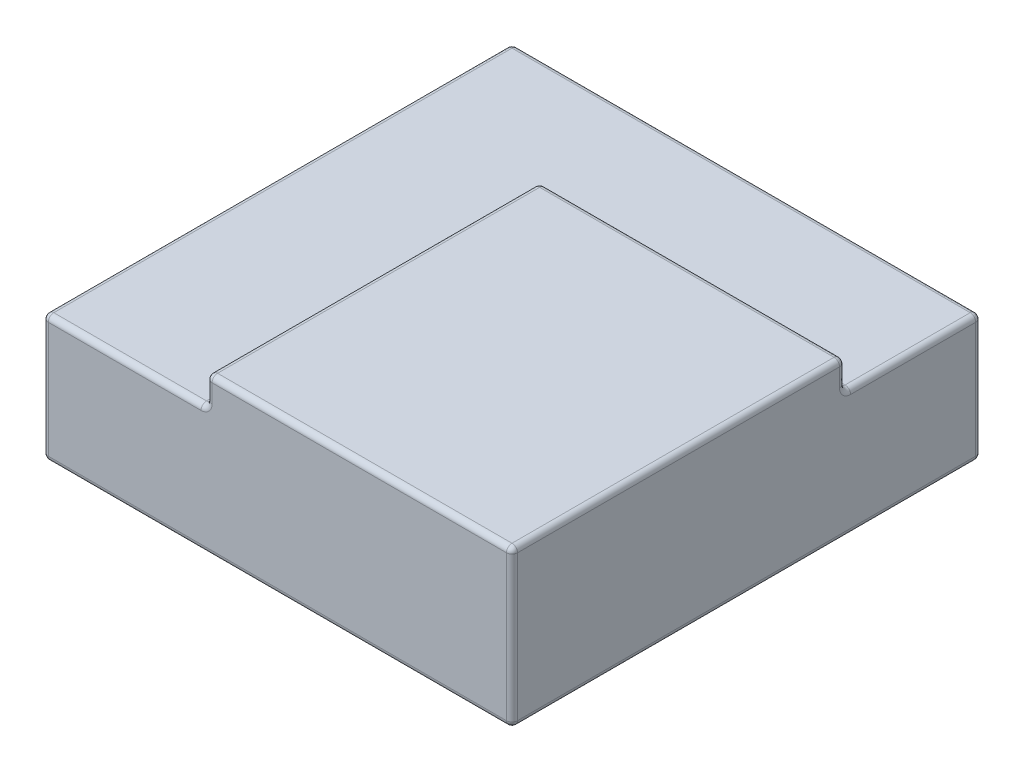
ISO-10303-21;
HEADER;
FILE_DESCRIPTION(('STEP AP214'),'2;1');
FILE_NAME('part.step','',(''),(''),'','','');
FILE_SCHEMA(('AUTOMOTIVE_DESIGN { 1 0 10303 214 1 1 1 1 }'));
ENDSEC;
DATA;
#1=APPLICATION_CONTEXT('core data for automotive mechanical design processes');
#2=APPLICATION_PROTOCOL_DEFINITION('international standard','automotive_design',2000,#1);
#3=PRODUCT_CONTEXT('',#1,'mechanical');
#4=PRODUCT('Part','Part','',(#3));
#5=PRODUCT_RELATED_PRODUCT_CATEGORY('part','',(#4));
#6=PRODUCT_DEFINITION_FORMATION('','',#4);
#7=PRODUCT_DEFINITION_CONTEXT('part definition',#1,'design');
#8=PRODUCT_DEFINITION('design','',#6,#7);
#9=PRODUCT_DEFINITION_SHAPE('','',#8);
#10=(LENGTH_UNIT() NAMED_UNIT(*) SI_UNIT(.MILLI.,.METRE.));
#11=(NAMED_UNIT(*) PLANE_ANGLE_UNIT() SI_UNIT($,.RADIAN.));
#12=(NAMED_UNIT(*) SI_UNIT($,.STERADIAN.) SOLID_ANGLE_UNIT());
#13=UNCERTAINTY_MEASURE_WITH_UNIT(LENGTH_MEASURE(1.E-05),#10,'distance_accuracy_value','');
#14=(GEOMETRIC_REPRESENTATION_CONTEXT(3) GLOBAL_UNCERTAINTY_ASSIGNED_CONTEXT((#13)) GLOBAL_UNIT_ASSIGNED_CONTEXT((#10,
#11,#12)) REPRESENTATION_CONTEXT('',''));
#15=CARTESIAN_POINT('',(0.,0.,0.));
#16=DIRECTION('',(0.,0.,1.));
#17=DIRECTION('',(1.,0.,0.));
#18=AXIS2_PLACEMENT_3D('',#15,#16,#17);
#19=CARTESIAN_POINT('',(0.,17.526,0.));
#20=DIRECTION('',(0.,1.,0.));
#21=DIRECTION('',(0.,0.,1.));
#22=AXIS2_PLACEMENT_3D('',#19,#20,#21);
#23=PLANE('',#22);
#24=CARTESIAN_POINT('',(-9.01699999999989,17.526,-12.8269999999999));
#25=DIRECTION('',(0.,1.,0.));
#26=DIRECTION('',(0.,0.,1.));
#27=AXIS2_PLACEMENT_3D('',#24,#25,#26);
#28=CIRCLE('',#27,1.524);
#29=CARTESIAN_POINT('',(-9.01699999999989,17.526,-14.3509999999999));
#30=VERTEX_POINT('',#29);
#31=CARTESIAN_POINT('',(-10.5409999999999,17.526,-12.8269999999999));
#32=VERTEX_POINT('',#31);
#33=EDGE_CURVE('E304',#30,#32,#28,.T.);
#34=ORIENTED_EDGE('',*,*,#33,.F.);
#35=DIRECTION('',(-1.,0.,0.));
#36=VECTOR('',#35,1.);
#37=CARTESIAN_POINT('',(32.3850000000001,17.526,-14.3509999999999));
#38=LINE('',#37,#36);
#39=CARTESIAN_POINT('',(31.6230000000001,17.526,-14.3509999999999));
#40=VERTEX_POINT('',#39);
#41=EDGE_CURVE('E301',#30,#40,#38,.F.);
#42=ORIENTED_EDGE('',*,*,#41,.T.);
#43=DIRECTION('',(0.,0.,-1.));
#44=VECTOR('',#43,1.);
#45=CARTESIAN_POINT('',(31.6230000000001,17.526,-32.3850000000001));
#46=LINE('',#45,#44);
#47=CARTESIAN_POINT('',(31.6230000000001,17.526,-31.6230000000001));
#48=VERTEX_POINT('',#47);
#49=EDGE_CURVE('E291',#40,#48,#46,.T.);
#50=ORIENTED_EDGE('',*,*,#49,.T.);
#51=DIRECTION('',(-1.,0.,0.));
#52=VECTOR('',#51,1.);
#53=CARTESIAN_POINT('',(-32.3850000000001,17.526,-31.6230000000001));
#54=LINE('',#53,#52);
#55=CARTESIAN_POINT('',(-31.6230000000001,17.526,-31.6230000000001));
#56=VERTEX_POINT('',#55);
#57=EDGE_CURVE('E293',#48,#56,#54,.T.);
#58=ORIENTED_EDGE('',*,*,#57,.T.);
#59=DIRECTION('',(0.,0.,1.));
#60=VECTOR('',#59,1.);
#61=CARTESIAN_POINT('',(-31.6230000000001,17.526,32.3850000000001));
#62=LINE('',#61,#60);
#63=CARTESIAN_POINT('',(-31.6230000000001,17.526,31.6230000000001));
#64=VERTEX_POINT('',#63);
#65=EDGE_CURVE('E295',#56,#64,#62,.T.);
#66=ORIENTED_EDGE('',*,*,#65,.T.);
#67=DIRECTION('',(1.,0.,0.));
#68=VECTOR('',#67,1.);
#69=CARTESIAN_POINT('',(-9.77899999999998,17.526,31.6230000000001));
#70=LINE('',#69,#68);
#71=CARTESIAN_POINT('',(-10.541,17.526,31.6230000000001));
#72=VERTEX_POINT('',#71);
#73=EDGE_CURVE('E297',#64,#72,#70,.T.);
#74=ORIENTED_EDGE('',*,*,#73,.T.);
#75=DIRECTION('',(0.,0.,1.));
#76=VECTOR('',#75,1.);
#77=CARTESIAN_POINT('',(-10.5409999999999,17.526,-13.5889999999999));
#78=LINE('',#77,#76);
#79=EDGE_CURVE('E299',#72,#32,#78,.F.);
#80=ORIENTED_EDGE('',*,*,#79,.T.);
#81=EDGE_LOOP('',(#34,#42,#50,#58,#66,#74,#80));
#82=FACE_BOUND('',#81,.T.);
#83=ADVANCED_FACE('F34',(#82),#23,.T.);
#84=CARTESIAN_POINT('',(32.3850000000001,21.59,32.3850000000001));
#85=DIRECTION('',(-1.,0.,0.));
#86=DIRECTION('',(0.,0.,1.));
#87=AXIS2_PLACEMENT_3D('',#84,#85,#86);
#88=PLANE('',#87);
#89=DIRECTION('',(0.,0.,-1.));
#90=VECTOR('',#89,1.);
#91=CARTESIAN_POINT('',(32.3850000000001,0.761999999999999,-32.3850000000001));
#92=LINE('',#91,#90);
#93=CARTESIAN_POINT('',(32.3850000000001,0.761999999999999,31.6230000000001));
#94=VERTEX_POINT('',#93);
#95=CARTESIAN_POINT('',(32.3850000000001,0.761999999999999,-31.6230000000001));
#96=VERTEX_POINT('',#95);
#97=EDGE_CURVE('E236',#94,#96,#92,.T.);
#98=ORIENTED_EDGE('',*,*,#97,.T.);
#99=DIRECTION('',(0.,-1.,0.));
#100=VECTOR('',#99,1.);
#101=CARTESIAN_POINT('',(32.3850000000001,21.59,-31.6230000000001));
#102=LINE('',#101,#100);
#103=CARTESIAN_POINT('',(32.3850000000001,16.764,-31.6230000000001));
#104=VERTEX_POINT('',#103);
#105=EDGE_CURVE('E246',#96,#104,#102,.F.);
#106=ORIENTED_EDGE('',*,*,#105,.T.);
#107=DIRECTION('',(0.,0.,-1.));
#108=VECTOR('',#107,1.);
#109=CARTESIAN_POINT('',(32.3850000000001,16.764,-13.5889999999999));
#110=LINE('',#109,#108);
#111=CARTESIAN_POINT('',(32.3850000000001,16.764,-14.3509999999999));
#112=VERTEX_POINT('',#111);
#113=EDGE_CURVE('E244',#104,#112,#110,.F.);
#114=ORIENTED_EDGE('',*,*,#113,.T.);
#115=CARTESIAN_POINT('',(32.3850000000001,18.288,-14.3509999999999));
#116=DIRECTION('',(-1.,0.,0.));
#117=DIRECTION('',(0.,0.,1.));
#118=AXIS2_PLACEMENT_3D('',#115,#116,#117);
#119=CIRCLE('',#118,1.524);
#120=CARTESIAN_POINT('',(32.3850000000001,18.288,-12.8269999999999));
#121=VERTEX_POINT('',#120);
#122=EDGE_CURVE('E241',#121,#112,#119,.F.);
#123=ORIENTED_EDGE('',*,*,#122,.F.);
#124=DIRECTION('',(0.,1.,0.));
#125=VECTOR('',#124,1.);
#126=CARTESIAN_POINT('',(32.3850000000001,21.59,-12.8269999999999));
#127=LINE('',#126,#125);
#128=CARTESIAN_POINT('',(32.3850000000001,20.828,-12.8269999999999));
#129=VERTEX_POINT('',#128);
#130=EDGE_CURVE('E238',#121,#129,#127,.T.);
#131=ORIENTED_EDGE('',*,*,#130,.T.);
#132=DIRECTION('',(0.,0.,-1.));
#133=VECTOR('',#132,1.);
#134=CARTESIAN_POINT('',(32.3850000000001,20.828,32.3850000000001));
#135=LINE('',#134,#133);
#136=CARTESIAN_POINT('',(32.3850000000001,20.828,31.6230000000001));
#137=VERTEX_POINT('',#136);
#138=EDGE_CURVE('E232',#129,#137,#135,.F.);
#139=ORIENTED_EDGE('',*,*,#138,.T.);
#140=DIRECTION('',(0.,-1.,0.));
#141=VECTOR('',#140,1.);
#142=CARTESIAN_POINT('',(32.3850000000001,21.59,31.6230000000001));
#143=LINE('',#142,#141);
#144=EDGE_CURVE('E234',#137,#94,#143,.T.);
#145=ORIENTED_EDGE('',*,*,#144,.T.);
#146=EDGE_LOOP('',(#98,#106,#114,#123,#131,#139,#145));
#147=FACE_BOUND('',#146,.T.);
#148=ADVANCED_FACE('F499',(#147),#88,.F.);
#149=CARTESIAN_POINT('',(-32.3850000000001,21.59,-32.3850000000001));
#150=DIRECTION('',(0.,0.,1.));
#151=DIRECTION('',(1.,0.,0.));
#152=AXIS2_PLACEMENT_3D('',#149,#150,#151);
#153=PLANE('',#152);
#154=DIRECTION('',(-1.,0.,0.));
#155=VECTOR('',#154,1.);
#156=CARTESIAN_POINT('',(-32.3850000000001,0.761999999999999,-32.3850000000001));
#157=LINE('',#156,#155);
#158=CARTESIAN_POINT('',(31.6230000000001,0.761999999999999,-32.3850000000001));
#159=VERTEX_POINT('',#158);
#160=CARTESIAN_POINT('',(-31.6230000000001,0.761999999999999,-32.3850000000001));
#161=VERTEX_POINT('',#160);
#162=EDGE_CURVE('E286',#159,#161,#157,.T.);
#163=ORIENTED_EDGE('',*,*,#162,.T.);
#164=DIRECTION('',(0.,-1.,0.));
#165=VECTOR('',#164,1.);
#166=CARTESIAN_POINT('',(-31.6230000000001,21.59,-32.3850000000001));
#167=LINE('',#166,#165);
#168=CARTESIAN_POINT('',(-31.6230000000001,16.764,-32.3850000000001));
#169=VERTEX_POINT('',#168);
#170=EDGE_CURVE('E288',#161,#169,#167,.F.);
#171=ORIENTED_EDGE('',*,*,#170,.T.);
#172=DIRECTION('',(-1.,0.,0.));
#173=VECTOR('',#172,1.);
#174=CARTESIAN_POINT('',(32.3850000000001,16.764,-32.3850000000001));
#175=LINE('',#174,#173);
#176=CARTESIAN_POINT('',(31.6230000000001,16.764,-32.3850000000001));
#177=VERTEX_POINT('',#176);
#178=EDGE_CURVE('E282',#169,#177,#175,.F.);
#179=ORIENTED_EDGE('',*,*,#178,.T.);
#180=DIRECTION('',(0.,-1.,0.));
#181=VECTOR('',#180,1.);
#182=CARTESIAN_POINT('',(31.6230000000001,21.59,-32.3850000000001));
#183=LINE('',#182,#181);
#184=EDGE_CURVE('E284',#177,#159,#183,.T.);
#185=ORIENTED_EDGE('',*,*,#184,.T.);
#186=EDGE_LOOP('',(#163,#171,#179,#185));
#187=FACE_BOUND('',#186,.T.);
#188=ADVANCED_FACE('F481',(#187),#153,.F.);
#189=CARTESIAN_POINT('',(-32.3850000000001,21.59,32.3850000000001));
#190=DIRECTION('',(1.,0.,0.));
#191=DIRECTION('',(0.,0.,-1.));
#192=AXIS2_PLACEMENT_3D('',#189,#190,#191);
#193=PLANE('',#192);
#194=DIRECTION('',(0.,0.,1.));
#195=VECTOR('',#194,1.);
#196=CARTESIAN_POINT('',(-32.3850000000001,0.761999999999999,32.3850000000001));
#197=LINE('',#196,#195);
#198=CARTESIAN_POINT('',(-32.3850000000001,0.761999999999999,-31.6230000000001));
#199=VERTEX_POINT('',#198);
#200=CARTESIAN_POINT('',(-32.3850000000001,0.761999999999999,31.6230000000001));
#201=VERTEX_POINT('',#200);
#202=EDGE_CURVE('E277',#199,#201,#197,.T.);
#203=ORIENTED_EDGE('',*,*,#202,.T.);
#204=DIRECTION('',(0.,-1.,0.));
#205=VECTOR('',#204,1.);
#206=CARTESIAN_POINT('',(-32.3850000000001,21.59,31.6230000000001));
#207=LINE('',#206,#205);
#208=CARTESIAN_POINT('',(-32.3850000000001,16.764,31.6230000000001));
#209=VERTEX_POINT('',#208);
#210=EDGE_CURVE('E279',#201,#209,#207,.F.);
#211=ORIENTED_EDGE('',*,*,#210,.T.);
#212=DIRECTION('',(0.,0.,1.));
#213=VECTOR('',#212,1.);
#214=CARTESIAN_POINT('',(-32.3850000000001,16.764,-32.3850000000001));
#215=LINE('',#214,#213);
#216=CARTESIAN_POINT('',(-32.3850000000001,16.764,-31.6230000000001));
#217=VERTEX_POINT('',#216);
#218=EDGE_CURVE('E273',#209,#217,#215,.F.);
#219=ORIENTED_EDGE('',*,*,#218,.T.);
#220=DIRECTION('',(0.,-1.,0.));
#221=VECTOR('',#220,1.);
#222=CARTESIAN_POINT('',(-32.3850000000001,21.59,-31.6230000000001));
#223=LINE('',#222,#221);
#224=EDGE_CURVE('E275',#217,#199,#223,.T.);
#225=ORIENTED_EDGE('',*,*,#224,.T.);
#226=EDGE_LOOP('',(#203,#211,#219,#225));
#227=FACE_BOUND('',#226,.T.);
#228=ADVANCED_FACE('F459',(#227),#193,.F.);
#229=CARTESIAN_POINT('',(0.,21.59,0.));
#230=DIRECTION('',(0.,-1.,0.));
#231=DIRECTION('',(0.,0.,-1.));
#232=AXIS2_PLACEMENT_3D('',#229,#230,#231);
#233=PLANE('',#232);
#234=DIRECTION('',(0.,0.,-1.));
#235=VECTOR('',#234,1.);
#236=CARTESIAN_POINT('',(31.6230000000001,21.59,0.));
#237=LINE('',#236,#235);
#238=CARTESIAN_POINT('',(31.6230000000001,21.59,31.6230000000001));
#239=VERTEX_POINT('',#238);
#240=CARTESIAN_POINT('',(31.6230000000001,21.59,-12.8269999999999));
#241=VERTEX_POINT('',#240);
#242=EDGE_CURVE('E43',#239,#241,#237,.T.);
#243=ORIENTED_EDGE('',*,*,#242,.T.);
#244=DIRECTION('',(-1.,0.,0.));
#245=VECTOR('',#244,1.);
#246=CARTESIAN_POINT('',(-9.77899999999989,21.59,-12.8269999999999));
#247=LINE('',#246,#245);
#248=CARTESIAN_POINT('',(-9.01699999999989,21.59,-12.8269999999999));
#249=VERTEX_POINT('',#248);
#250=EDGE_CURVE('E12',#241,#249,#247,.T.);
#251=ORIENTED_EDGE('',*,*,#250,.T.);
#252=DIRECTION('',(0.,0.,1.));
#253=VECTOR('',#252,1.);
#254=CARTESIAN_POINT('',(-9.01699999999998,21.59,32.3850000000001));
#255=LINE('',#254,#253);
#256=CARTESIAN_POINT('',(-9.01699999999998,21.59,31.6230000000001));
#257=VERTEX_POINT('',#256);
#258=EDGE_CURVE('E307',#249,#257,#255,.T.);
#259=ORIENTED_EDGE('',*,*,#258,.T.);
#260=DIRECTION('',(1.,0.,0.));
#261=VECTOR('',#260,1.);
#262=CARTESIAN_POINT('',(0.,21.59,31.6230000000001));
#263=LINE('',#262,#261);
#264=EDGE_CURVE('E54',#257,#239,#263,.T.);
#265=ORIENTED_EDGE('',*,*,#264,.T.);
#266=EDGE_LOOP('',(#243,#251,#259,#265));
#267=FACE_BOUND('',#266,.T.);
#268=ADVANCED_FACE('F509',(#267),#233,.F.);
#269=CARTESIAN_POINT('',(-32.3850000000001,21.59,32.3850000000001));
#270=DIRECTION('',(0.,0.,-1.));
#271=DIRECTION('',(-1.,0.,0.));
#272=AXIS2_PLACEMENT_3D('',#269,#270,#271);
#273=PLANE('',#272);
#274=DIRECTION('',(1.,0.,0.));
#275=VECTOR('',#274,1.);
#276=CARTESIAN_POINT('',(-32.3850000000001,16.764,32.3850000000001));
#277=LINE('',#276,#275);
#278=CARTESIAN_POINT('',(-10.541,16.764,32.3850000000001));
#279=VERTEX_POINT('',#278);
#280=CARTESIAN_POINT('',(-31.6230000000001,16.764,32.3850000000001));
#281=VERTEX_POINT('',#280);
#282=EDGE_CURVE('E269',#279,#281,#277,.F.);
#283=ORIENTED_EDGE('',*,*,#282,.T.);
#284=DIRECTION('',(0.,-1.,0.));
#285=VECTOR('',#284,1.);
#286=CARTESIAN_POINT('',(-31.6230000000001,21.59,32.3850000000001));
#287=LINE('',#286,#285);
#288=CARTESIAN_POINT('',(-31.6230000000001,0.761999999999999,32.3850000000001));
#289=VERTEX_POINT('',#288);
#290=EDGE_CURVE('E271',#281,#289,#287,.T.);
#291=ORIENTED_EDGE('',*,*,#290,.T.);
#292=DIRECTION('',(1.,0.,0.));
#293=VECTOR('',#292,1.);
#294=CARTESIAN_POINT('',(32.3850000000001,0.761999999999999,32.3850000000001));
#295=LINE('',#294,#293);
#296=CARTESIAN_POINT('',(31.6230000000001,0.761999999999999,32.3850000000001));
#297=VERTEX_POINT('',#296);
#298=EDGE_CURVE('E267',#289,#297,#295,.T.);
#299=ORIENTED_EDGE('',*,*,#298,.T.);
#300=DIRECTION('',(0.,-1.,0.));
#301=VECTOR('',#300,1.);
#302=CARTESIAN_POINT('',(31.6230000000001,21.59,32.3850000000001));
#303=LINE('',#302,#301);
#304=CARTESIAN_POINT('',(31.6230000000001,20.828,32.3850000000001));
#305=VERTEX_POINT('',#304);
#306=EDGE_CURVE('E261',#297,#305,#303,.F.);
#307=ORIENTED_EDGE('',*,*,#306,.T.);
#308=DIRECTION('',(1.,0.,0.));
#309=VECTOR('',#308,1.);
#310=CARTESIAN_POINT('',(-32.3850000000001,20.828,32.3850000000001));
#311=LINE('',#310,#309);
#312=CARTESIAN_POINT('',(-9.01699999999998,20.828,32.3850000000001));
#313=VERTEX_POINT('',#312);
#314=EDGE_CURVE('E257',#305,#313,#311,.F.);
#315=ORIENTED_EDGE('',*,*,#314,.T.);
#316=DIRECTION('',(0.,1.,0.));
#317=VECTOR('',#316,1.);
#318=CARTESIAN_POINT('',(-9.01699999999998,17.526,32.3850000000001));
#319=LINE('',#318,#317);
#320=CARTESIAN_POINT('',(-9.01699999999998,18.288,32.3850000000001));
#321=VERTEX_POINT('',#320);
#322=EDGE_CURVE('E259',#313,#321,#319,.F.);
#323=ORIENTED_EDGE('',*,*,#322,.T.);
#324=CARTESIAN_POINT('',(-10.541,18.288,32.3850000000001));
#325=DIRECTION('',(0.,0.,-1.));
#326=DIRECTION('',(-1.,0.,0.));
#327=AXIS2_PLACEMENT_3D('',#324,#325,#326);
#328=CIRCLE('',#327,1.524);
#329=EDGE_CURVE('E264',#279,#321,#328,.F.);
#330=ORIENTED_EDGE('',*,*,#329,.F.);
#331=EDGE_LOOP('',(#283,#291,#299,#307,#315,#323,#330));
#332=FACE_BOUND('',#331,.T.);
#333=ADVANCED_FACE('F512',(#332),#273,.F.);
#334=CARTESIAN_POINT('',(0.,0.,0.));
#335=DIRECTION('',(0.,-1.,0.));
#336=DIRECTION('',(0.,0.,-1.));
#337=AXIS2_PLACEMENT_3D('',#334,#335,#336);
#338=PLANE('',#337);
#339=DIRECTION('',(-1.,0.,0.));
#340=VECTOR('',#339,1.);
#341=CARTESIAN_POINT('',(32.3850000000001,0.,-31.6230000000001));
#342=LINE('',#341,#340);
#343=CARTESIAN_POINT('',(-31.6230000000001,0.,-31.6230000000001));
#344=VERTEX_POINT('',#343);
#345=CARTESIAN_POINT('',(31.6230000000001,0.,-31.6230000000001));
#346=VERTEX_POINT('',#345);
#347=EDGE_CURVE('E248',#344,#346,#342,.F.);
#348=ORIENTED_EDGE('',*,*,#347,.T.);
#349=DIRECTION('',(0.,0.,-1.));
#350=VECTOR('',#349,1.);
#351=CARTESIAN_POINT('',(31.6230000000001,0.,32.3850000000001));
#352=LINE('',#351,#350);
#353=CARTESIAN_POINT('',(31.6230000000001,0.,31.6230000000001));
#354=VERTEX_POINT('',#353);
#355=EDGE_CURVE('E254',#346,#354,#352,.F.);
#356=ORIENTED_EDGE('',*,*,#355,.T.);
#357=DIRECTION('',(1.,0.,0.));
#358=VECTOR('',#357,1.);
#359=CARTESIAN_POINT('',(-32.3850000000001,0.,31.6230000000001));
#360=LINE('',#359,#358);
#361=CARTESIAN_POINT('',(-31.6230000000001,0.,31.6230000000001));
#362=VERTEX_POINT('',#361);
#363=EDGE_CURVE('E252',#354,#362,#360,.F.);
#364=ORIENTED_EDGE('',*,*,#363,.T.);
#365=DIRECTION('',(0.,0.,1.));
#366=VECTOR('',#365,1.);
#367=CARTESIAN_POINT('',(-31.6230000000001,0.,-32.3850000000001));
#368=LINE('',#367,#366);
#369=EDGE_CURVE('E250',#362,#344,#368,.F.);
#370=ORIENTED_EDGE('',*,*,#369,.T.);
#371=EDGE_LOOP('',(#348,#356,#364,#370));
#372=FACE_BOUND('',#371,.T.);
#373=ADVANCED_FACE('F435',(#372),#338,.T.);
#374=CARTESIAN_POINT('',(-9.77899999999998,17.526,32.3850000000001));
#375=DIRECTION('',(-1.,0.,0.));
#376=DIRECTION('',(0.,0.,1.));
#377=AXIS2_PLACEMENT_3D('',#374,#375,#376);
#378=PLANE('',#377);
#379=DIRECTION('',(0.,1.,0.));
#380=VECTOR('',#379,1.);
#381=CARTESIAN_POINT('',(-9.77899999999989,17.526,-12.8269999999999));
#382=LINE('',#381,#380);
#383=CARTESIAN_POINT('',(-9.77899999999989,20.828,-12.8269999999999));
#384=VERTEX_POINT('',#383);
#385=CARTESIAN_POINT('',(-9.77899999999989,18.288,-12.8269999999999));
#386=VERTEX_POINT('',#385);
#387=EDGE_CURVE('E193',#384,#386,#382,.F.);
#388=ORIENTED_EDGE('',*,*,#387,.T.);
#389=DIRECTION('',(0.,0.,1.));
#390=VECTOR('',#389,1.);
#391=CARTESIAN_POINT('',(-9.77899999999998,18.288,32.3850000000001));
#392=LINE('',#391,#390);
#393=CARTESIAN_POINT('',(-9.77899999999998,18.288,31.6230000000001));
#394=VERTEX_POINT('',#393);
#395=EDGE_CURVE('E230',#386,#394,#392,.T.);
#396=ORIENTED_EDGE('',*,*,#395,.T.);
#397=DIRECTION('',(0.,1.,0.));
#398=VECTOR('',#397,1.);
#399=CARTESIAN_POINT('',(-9.77899999999998,21.59,31.6230000000001));
#400=LINE('',#399,#398);
#401=CARTESIAN_POINT('',(-9.77899999999998,20.828,31.6230000000001));
#402=VERTEX_POINT('',#401);
#403=EDGE_CURVE('E227',#394,#402,#400,.T.);
#404=ORIENTED_EDGE('',*,*,#403,.T.);
#405=DIRECTION('',(0.,0.,1.));
#406=VECTOR('',#405,1.);
#407=CARTESIAN_POINT('',(-9.77899999999989,20.828,-13.5889999999999));
#408=LINE('',#407,#406);
#409=EDGE_CURVE('E222',#402,#384,#408,.F.);
#410=ORIENTED_EDGE('',*,*,#409,.T.);
#411=EDGE_LOOP('',(#388,#396,#404,#410));
#412=FACE_BOUND('',#411,.T.);
#413=ADVANCED_FACE('F515',(#412),#378,.T.);
#414=CARTESIAN_POINT('',(32.3850000000001,17.526,-13.5889999999999));
#415=DIRECTION('',(0.,0.,-1.));
#416=DIRECTION('',(-1.,0.,0.));
#417=AXIS2_PLACEMENT_3D('',#414,#415,#416);
#418=PLANE('',#417);
#419=DIRECTION('',(0.,1.,0.));
#420=VECTOR('',#419,1.);
#421=CARTESIAN_POINT('',(31.6230000000001,17.526,-13.5889999999999));
#422=LINE('',#421,#420);
#423=CARTESIAN_POINT('',(31.6230000000001,20.828,-13.5889999999999));
#424=VERTEX_POINT('',#423);
#425=CARTESIAN_POINT('',(31.6230000000001,18.288,-13.5889999999999));
#426=VERTEX_POINT('',#425);
#427=EDGE_CURVE('E215',#424,#426,#422,.F.);
#428=ORIENTED_EDGE('',*,*,#427,.T.);
#429=DIRECTION('',(-1.,0.,0.));
#430=VECTOR('',#429,1.);
#431=CARTESIAN_POINT('',(-9.77899999999989,18.288,-13.5889999999999));
#432=LINE('',#431,#430);
#433=CARTESIAN_POINT('',(-9.01699999999989,18.288,-13.5889999999999));
#434=VERTEX_POINT('',#433);
#435=EDGE_CURVE('E219',#426,#434,#432,.T.);
#436=ORIENTED_EDGE('',*,*,#435,.T.);
#437=DIRECTION('',(0.,1.,0.));
#438=VECTOR('',#437,1.);
#439=CARTESIAN_POINT('',(-9.01699999999989,17.526,-13.5889999999999));
#440=LINE('',#439,#438);
#441=CARTESIAN_POINT('',(-9.01699999999989,20.828,-13.5889999999999));
#442=VERTEX_POINT('',#441);
#443=EDGE_CURVE('E191',#434,#442,#440,.T.);
#444=ORIENTED_EDGE('',*,*,#443,.T.);
#445=DIRECTION('',(-1.,0.,0.));
#446=VECTOR('',#445,1.);
#447=CARTESIAN_POINT('',(32.3850000000001,20.828,-13.5889999999999));
#448=LINE('',#447,#446);
#449=EDGE_CURVE('E209',#442,#424,#448,.F.);
#450=ORIENTED_EDGE('',*,*,#449,.T.);
#451=EDGE_LOOP('',(#428,#436,#444,#450));
#452=FACE_BOUND('',#451,.T.);
#453=ADVANCED_FACE('F217',(#452),#418,.T.);
#454=CARTESIAN_POINT('',(-31.6230000000001,0.762,-31.6230000000001));
#455=DIRECTION('',(0.,0.,1.));
#456=DIRECTION('',(1.,0.,0.));
#457=AXIS2_PLACEMENT_3D('',#454,#455,#456);
#458=SPHERICAL_SURFACE('',#457,0.762);
#459=CARTESIAN_POINT('',(-31.6230000000001,0.761999999999999,-31.6230000000001));
#460=DIRECTION('',(-1.,0.,0.));
#461=DIRECTION('',(0.,0.,1.));
#462=AXIS2_PLACEMENT_3D('',#459,#460,#461);
#463=CIRCLE('',#462,0.762);
#464=EDGE_CURVE('E410',#344,#161,#463,.F.);
#465=ORIENTED_EDGE('',*,*,#464,.F.);
#466=CARTESIAN_POINT('',(-31.6230000000001,0.762,-31.6230000000001));
#467=DIRECTION('',(0.,0.,-1.));
#468=DIRECTION('',(-1.,0.,0.));
#469=AXIS2_PLACEMENT_3D('',#466,#467,#468);
#470=CIRCLE('',#469,0.762);
#471=EDGE_CURVE('E38',#199,#344,#470,.F.);
#472=ORIENTED_EDGE('',*,*,#471,.F.);
#473=CARTESIAN_POINT('',(-31.6230000000001,0.761999999999999,-31.6230000000001));
#474=DIRECTION('',(0.,-1.,0.));
#475=DIRECTION('',(0.,0.,-1.));
#476=AXIS2_PLACEMENT_3D('',#473,#474,#475);
#477=CIRCLE('',#476,0.762);
#478=EDGE_CURVE('E412',#161,#199,#477,.F.);
#479=ORIENTED_EDGE('',*,*,#478,.F.);
#480=EDGE_LOOP('',(#465,#472,#479));
#481=FACE_BOUND('',#480,.T.);
#482=ADVANCED_FACE('F36',(#481),#458,.T.);
#483=CARTESIAN_POINT('',(-31.6230000000001,0.761999999999999,32.3850000000001));
#484=DIRECTION('',(0.,0.,-1.));
#485=DIRECTION('',(-1.,0.,0.));
#486=AXIS2_PLACEMENT_3D('',#483,#484,#485);
#487=CYLINDRICAL_SURFACE('',#486,0.762);
#488=ORIENTED_EDGE('',*,*,#471,.T.);
#489=ORIENTED_EDGE('',*,*,#369,.F.);
#490=CARTESIAN_POINT('',(-31.6230000000001,0.761999999999999,31.6230000000001));
#491=DIRECTION('',(0.,0.,1.));
#492=DIRECTION('',(1.,0.,0.));
#493=AXIS2_PLACEMENT_3D('',#490,#491,#492);
#494=CIRCLE('',#493,0.762);
#495=EDGE_CURVE('E404',#201,#362,#494,.T.);
#496=ORIENTED_EDGE('',*,*,#495,.F.);
#497=ORIENTED_EDGE('',*,*,#202,.F.);
#498=EDGE_LOOP('',(#488,#489,#496,#497));
#499=FACE_BOUND('',#498,.T.);
#500=ADVANCED_FACE('F424',(#499),#487,.T.);
#501=CARTESIAN_POINT('',(-31.6230000000001,21.59,-31.6230000000001));
#502=DIRECTION('',(0.,-1.,0.));
#503=DIRECTION('',(0.,0.,-1.));
#504=AXIS2_PLACEMENT_3D('',#501,#502,#503);
#505=CYLINDRICAL_SURFACE('',#504,0.762);
#506=ORIENTED_EDGE('',*,*,#478,.T.);
#507=ORIENTED_EDGE('',*,*,#224,.F.);
#508=CARTESIAN_POINT('',(-31.6230000000001,16.764,-31.6230000000001));
#509=DIRECTION('',(0.,1.,0.));
#510=DIRECTION('',(0.,0.,1.));
#511=AXIS2_PLACEMENT_3D('',#508,#509,#510);
#512=CIRCLE('',#511,0.762);
#513=EDGE_CURVE('E401',#169,#217,#512,.T.);
#514=ORIENTED_EDGE('',*,*,#513,.F.);
#515=ORIENTED_EDGE('',*,*,#170,.F.);
#516=EDGE_LOOP('',(#506,#507,#514,#515));
#517=FACE_BOUND('',#516,.T.);
#518=ADVANCED_FACE('F461',(#517),#505,.T.);
#519=CARTESIAN_POINT('',(-32.3850000000001,0.761999999999999,-31.6230000000001));
#520=DIRECTION('',(1.,0.,0.));
#521=DIRECTION('',(0.,0.,-1.));
#522=AXIS2_PLACEMENT_3D('',#519,#520,#521);
#523=CYLINDRICAL_SURFACE('',#522,0.762);
#524=ORIENTED_EDGE('',*,*,#464,.T.);
#525=ORIENTED_EDGE('',*,*,#162,.F.);
#526=CARTESIAN_POINT('',(31.6230000000001,0.762,-31.6230000000001));
#527=DIRECTION('',(1.,0.,0.));
#528=DIRECTION('',(0.,0.,-1.));
#529=AXIS2_PLACEMENT_3D('',#526,#527,#528);
#530=CIRCLE('',#529,0.762);
#531=EDGE_CURVE('E398',#346,#159,#530,.T.);
#532=ORIENTED_EDGE('',*,*,#531,.F.);
#533=ORIENTED_EDGE('',*,*,#347,.F.);
#534=EDGE_LOOP('',(#524,#525,#532,#533));
#535=FACE_BOUND('',#534,.T.);
#536=ADVANCED_FACE('F432',(#535),#523,.T.);
#537=CARTESIAN_POINT('',(31.6230000000001,0.761999999999999,32.3850000000001));
#538=DIRECTION('',(0.,0.,1.));
#539=DIRECTION('',(1.,0.,0.));
#540=AXIS2_PLACEMENT_3D('',#537,#538,#539);
#541=CYLINDRICAL_SURFACE('',#540,0.762);
#542=CARTESIAN_POINT('',(31.6230000000001,0.762,31.6230000000001));
#543=DIRECTION('',(0.,0.,1.));
#544=DIRECTION('',(1.,0.,0.));
#545=AXIS2_PLACEMENT_3D('',#542,#543,#544);
#546=CIRCLE('',#545,0.762);
#547=EDGE_CURVE('E392',#354,#94,#546,.T.);
#548=ORIENTED_EDGE('',*,*,#547,.F.);
#549=ORIENTED_EDGE('',*,*,#355,.F.);
#550=CARTESIAN_POINT('',(31.6230000000001,0.761999999999999,-31.6230000000001));
#551=DIRECTION('',(0.,0.,-1.));
#552=DIRECTION('',(-1.,0.,0.));
#553=AXIS2_PLACEMENT_3D('',#550,#551,#552);
#554=CIRCLE('',#553,0.762);
#555=EDGE_CURVE('E395',#96,#346,#554,.T.);
#556=ORIENTED_EDGE('',*,*,#555,.F.);
#557=ORIENTED_EDGE('',*,*,#97,.F.);
#558=EDGE_LOOP('',(#548,#549,#556,#557));
#559=FACE_BOUND('',#558,.T.);
#560=ADVANCED_FACE('F439',(#559),#541,.T.);
#561=CARTESIAN_POINT('',(-32.3850000000001,0.761999999999999,31.6230000000001));
#562=DIRECTION('',(-1.,0.,0.));
#563=DIRECTION('',(0.,0.,1.));
#564=AXIS2_PLACEMENT_3D('',#561,#562,#563);
#565=CYLINDRICAL_SURFACE('',#564,0.762);
#566=CARTESIAN_POINT('',(-31.6230000000001,0.762,31.6230000000001));
#567=DIRECTION('',(-1.,0.,0.));
#568=DIRECTION('',(0.,0.,1.));
#569=AXIS2_PLACEMENT_3D('',#566,#567,#568);
#570=CIRCLE('',#569,0.762);
#571=EDGE_CURVE('E407',#362,#289,#570,.T.);
#572=ORIENTED_EDGE('',*,*,#571,.F.);
#573=ORIENTED_EDGE('',*,*,#363,.F.);
#574=CARTESIAN_POINT('',(31.6230000000001,0.761999999999999,31.6230000000001));
#575=DIRECTION('',(1.,0.,0.));
#576=DIRECTION('',(0.,0.,-1.));
#577=AXIS2_PLACEMENT_3D('',#574,#575,#576);
#578=CIRCLE('',#577,0.762);
#579=EDGE_CURVE('E390',#297,#354,#578,.T.);
#580=ORIENTED_EDGE('',*,*,#579,.F.);
#581=ORIENTED_EDGE('',*,*,#298,.F.);
#582=EDGE_LOOP('',(#572,#573,#580,#581));
#583=FACE_BOUND('',#582,.T.);
#584=ADVANCED_FACE('F447',(#583),#565,.T.);
#585=CARTESIAN_POINT('',(-31.6230000000001,0.762,31.6230000000001));
#586=DIRECTION('',(0.,0.,1.));
#587=DIRECTION('',(1.,0.,0.));
#588=AXIS2_PLACEMENT_3D('',#585,#586,#587);
#589=SPHERICAL_SURFACE('',#588,0.762);
#590=ORIENTED_EDGE('',*,*,#495,.T.);
#591=ORIENTED_EDGE('',*,*,#571,.T.);
#592=CARTESIAN_POINT('',(-31.6230000000001,0.761999999999999,31.6230000000001));
#593=DIRECTION('',(0.,-1.,0.));
#594=DIRECTION('',(0.,0.,-1.));
#595=AXIS2_PLACEMENT_3D('',#592,#593,#594);
#596=CIRCLE('',#595,0.762);
#597=EDGE_CURVE('E387',#201,#289,#596,.F.);
#598=ORIENTED_EDGE('',*,*,#597,.F.);
#599=EDGE_LOOP('',(#590,#591,#598));
#600=FACE_BOUND('',#599,.T.);
#601=ADVANCED_FACE('F451',(#600),#589,.T.);
#602=CARTESIAN_POINT('',(-31.6230000000001,16.764,-31.6230000000001));
#603=DIRECTION('',(0.,0.,1.));
#604=DIRECTION('',(1.,0.,0.));
#605=AXIS2_PLACEMENT_3D('',#602,#603,#604);
#606=SPHERICAL_SURFACE('',#605,0.762);
#607=CARTESIAN_POINT('',(-31.6230000000001,16.764,-31.6230000000001));
#608=DIRECTION('',(-1.,0.,0.));
#609=DIRECTION('',(0.,0.,1.));
#610=AXIS2_PLACEMENT_3D('',#607,#608,#609);
#611=CIRCLE('',#610,0.762);
#612=EDGE_CURVE('E381',#169,#56,#611,.F.);
#613=ORIENTED_EDGE('',*,*,#612,.F.);
#614=ORIENTED_EDGE('',*,*,#513,.T.);
#615=CARTESIAN_POINT('',(-31.6230000000001,16.764,-31.6230000000001));
#616=DIRECTION('',(0.,0.,-1.));
#617=DIRECTION('',(-1.,0.,0.));
#618=AXIS2_PLACEMENT_3D('',#615,#616,#617);
#619=CIRCLE('',#618,0.762);
#620=EDGE_CURVE('E384',#56,#217,#619,.F.);
#621=ORIENTED_EDGE('',*,*,#620,.F.);
#622=EDGE_LOOP('',(#613,#614,#621));
#623=FACE_BOUND('',#622,.T.);
#624=ADVANCED_FACE('F465',(#623),#606,.T.);
#625=CARTESIAN_POINT('',(31.6230000000001,0.762,-31.6230000000001));
#626=DIRECTION('',(0.,0.,1.));
#627=DIRECTION('',(1.,0.,0.));
#628=AXIS2_PLACEMENT_3D('',#625,#626,#627);
#629=SPHERICAL_SURFACE('',#628,0.762);
#630=ORIENTED_EDGE('',*,*,#555,.T.);
#631=ORIENTED_EDGE('',*,*,#531,.T.);
#632=CARTESIAN_POINT('',(31.6230000000001,0.761999999999999,-31.6230000000001));
#633=DIRECTION('',(0.,-1.,0.));
#634=DIRECTION('',(0.,0.,-1.));
#635=AXIS2_PLACEMENT_3D('',#632,#633,#634);
#636=CIRCLE('',#635,0.762);
#637=EDGE_CURVE('E378',#96,#159,#636,.F.);
#638=ORIENTED_EDGE('',*,*,#637,.F.);
#639=EDGE_LOOP('',(#630,#631,#638));
#640=FACE_BOUND('',#639,.T.);
#641=ADVANCED_FACE('F488',(#640),#629,.T.);
#642=CARTESIAN_POINT('',(31.6230000000001,0.762,31.6230000000001));
#643=DIRECTION('',(0.,0.,1.));
#644=DIRECTION('',(1.,0.,0.));
#645=AXIS2_PLACEMENT_3D('',#642,#643,#644);
#646=SPHERICAL_SURFACE('',#645,0.762);
#647=ORIENTED_EDGE('',*,*,#579,.T.);
#648=ORIENTED_EDGE('',*,*,#547,.T.);
#649=CARTESIAN_POINT('',(31.6230000000001,0.761999999999999,31.6230000000001));
#650=DIRECTION('',(0.,-1.,0.));
#651=DIRECTION('',(0.,0.,-1.));
#652=AXIS2_PLACEMENT_3D('',#649,#650,#651);
#653=CIRCLE('',#652,0.762);
#654=EDGE_CURVE('E375',#297,#94,#653,.F.);
#655=ORIENTED_EDGE('',*,*,#654,.F.);
#656=EDGE_LOOP('',(#647,#648,#655));
#657=FACE_BOUND('',#656,.T.);
#658=ADVANCED_FACE('F490',(#657),#646,.T.);
#659=CARTESIAN_POINT('',(-31.6230000000001,21.59,31.6230000000001));
#660=DIRECTION('',(0.,-1.,0.));
#661=DIRECTION('',(0.,0.,-1.));
#662=AXIS2_PLACEMENT_3D('',#659,#660,#661);
#663=CYLINDRICAL_SURFACE('',#662,0.762);
#664=ORIENTED_EDGE('',*,*,#597,.T.);
#665=ORIENTED_EDGE('',*,*,#290,.F.);
#666=CARTESIAN_POINT('',(-31.6230000000001,16.764,31.6230000000001));
#667=DIRECTION('',(0.,1.,0.));
#668=DIRECTION('',(0.,0.,1.));
#669=AXIS2_PLACEMENT_3D('',#666,#667,#668);
#670=CIRCLE('',#669,0.762);
#671=EDGE_CURVE('E372',#209,#281,#670,.T.);
#672=ORIENTED_EDGE('',*,*,#671,.F.);
#673=ORIENTED_EDGE('',*,*,#210,.F.);
#674=EDGE_LOOP('',(#664,#665,#672,#673));
#675=FACE_BOUND('',#674,.T.);
#676=ADVANCED_FACE('F456',(#675),#663,.T.);
#677=CARTESIAN_POINT('',(-31.6230000000001,16.764,0.));
#678=DIRECTION('',(0.,0.,-1.));
#679=DIRECTION('',(-1.,0.,0.));
#680=AXIS2_PLACEMENT_3D('',#677,#678,#679);
#681=CYLINDRICAL_SURFACE('',#680,0.762);
#682=ORIENTED_EDGE('',*,*,#620,.T.);
#683=ORIENTED_EDGE('',*,*,#218,.F.);
#684=CARTESIAN_POINT('',(-31.6230000000001,16.764,31.6230000000001));
#685=DIRECTION('',(0.,0.,1.));
#686=DIRECTION('',(1.,0.,0.));
#687=AXIS2_PLACEMENT_3D('',#684,#685,#686);
#688=CIRCLE('',#687,0.762);
#689=EDGE_CURVE('E370',#64,#209,#688,.T.);
#690=ORIENTED_EDGE('',*,*,#689,.F.);
#691=ORIENTED_EDGE('',*,*,#65,.F.);
#692=EDGE_LOOP('',(#682,#683,#690,#691));
#693=FACE_BOUND('',#692,.T.);
#694=ADVANCED_FACE('F468',(#693),#681,.T.);
#695=CARTESIAN_POINT('',(0.,16.764,-31.6230000000001));
#696=DIRECTION('',(1.,0.,0.));
#697=DIRECTION('',(0.,0.,-1.));
#698=AXIS2_PLACEMENT_3D('',#695,#696,#697);
#699=CYLINDRICAL_SURFACE('',#698,0.762);
#700=ORIENTED_EDGE('',*,*,#612,.T.);
#701=ORIENTED_EDGE('',*,*,#57,.F.);
#702=CARTESIAN_POINT('',(31.6230000000001,16.764,-31.6230000000001));
#703=DIRECTION('',(1.,0.,0.));
#704=DIRECTION('',(0.,0.,-1.));
#705=AXIS2_PLACEMENT_3D('',#702,#703,#704);
#706=CIRCLE('',#705,0.762);
#707=EDGE_CURVE('E367',#177,#48,#706,.T.);
#708=ORIENTED_EDGE('',*,*,#707,.F.);
#709=ORIENTED_EDGE('',*,*,#178,.F.);
#710=EDGE_LOOP('',(#700,#701,#708,#709));
#711=FACE_BOUND('',#710,.T.);
#712=ADVANCED_FACE('F478',(#711),#699,.T.);
#713=CARTESIAN_POINT('',(31.6230000000001,21.59,-31.6230000000001));
#714=DIRECTION('',(0.,-1.,0.));
#715=DIRECTION('',(0.,0.,-1.));
#716=AXIS2_PLACEMENT_3D('',#713,#714,#715);
#717=CYLINDRICAL_SURFACE('',#716,0.762);
#718=ORIENTED_EDGE('',*,*,#637,.T.);
#719=ORIENTED_EDGE('',*,*,#184,.F.);
#720=CARTESIAN_POINT('',(31.6230000000001,16.764,-31.6230000000001));
#721=DIRECTION('',(0.,1.,0.));
#722=DIRECTION('',(0.,0.,1.));
#723=AXIS2_PLACEMENT_3D('',#720,#721,#722);
#724=CIRCLE('',#723,0.762);
#725=EDGE_CURVE('E364',#104,#177,#724,.T.);
#726=ORIENTED_EDGE('',*,*,#725,.F.);
#727=ORIENTED_EDGE('',*,*,#105,.F.);
#728=EDGE_LOOP('',(#718,#719,#726,#727));
#729=FACE_BOUND('',#728,.T.);
#730=ADVANCED_FACE('F484',(#729),#717,.T.);
#731=CARTESIAN_POINT('',(31.6230000000001,21.59,31.6230000000001));
#732=DIRECTION('',(0.,-1.,0.));
#733=DIRECTION('',(0.,0.,-1.));
#734=AXIS2_PLACEMENT_3D('',#731,#732,#733);
#735=CYLINDRICAL_SURFACE('',#734,0.762);
#736=ORIENTED_EDGE('',*,*,#654,.T.);
#737=ORIENTED_EDGE('',*,*,#144,.F.);
#738=CARTESIAN_POINT('',(31.6230000000001,20.828,31.6230000000001));
#739=DIRECTION('',(0.,1.,0.));
#740=DIRECTION('',(0.,0.,1.));
#741=AXIS2_PLACEMENT_3D('',#738,#739,#740);
#742=CIRCLE('',#741,0.762);
#743=EDGE_CURVE('E361',#305,#137,#742,.T.);
#744=ORIENTED_EDGE('',*,*,#743,.F.);
#745=ORIENTED_EDGE('',*,*,#306,.F.);
#746=EDGE_LOOP('',(#736,#737,#744,#745));
#747=FACE_BOUND('',#746,.T.);
#748=ADVANCED_FACE('F596',(#747),#735,.T.);
#749=CARTESIAN_POINT('',(-31.6230000000001,16.764,31.6230000000001));
#750=DIRECTION('',(0.,0.,1.));
#751=DIRECTION('',(1.,0.,0.));
#752=AXIS2_PLACEMENT_3D('',#749,#750,#751);
#753=SPHERICAL_SURFACE('',#752,0.762);
#754=ORIENTED_EDGE('',*,*,#689,.T.);
#755=ORIENTED_EDGE('',*,*,#671,.T.);
#756=CARTESIAN_POINT('',(-31.6230000000001,16.764,31.6230000000001));
#757=DIRECTION('',(-1.,0.,0.));
#758=DIRECTION('',(0.,0.,1.));
#759=AXIS2_PLACEMENT_3D('',#756,#757,#758);
#760=CIRCLE('',#759,0.762);
#761=EDGE_CURVE('E358',#64,#281,#760,.F.);
#762=ORIENTED_EDGE('',*,*,#761,.F.);
#763=EDGE_LOOP('',(#754,#755,#762));
#764=FACE_BOUND('',#763,.T.);
#765=ADVANCED_FACE('F592',(#764),#753,.T.);
#766=CARTESIAN_POINT('',(31.6230000000001,16.764,-31.6230000000001));
#767=DIRECTION('',(0.,0.,1.));
#768=DIRECTION('',(1.,0.,0.));
#769=AXIS2_PLACEMENT_3D('',#766,#767,#768);
#770=SPHERICAL_SURFACE('',#769,0.762);
#771=ORIENTED_EDGE('',*,*,#725,.T.);
#772=ORIENTED_EDGE('',*,*,#707,.T.);
#773=CARTESIAN_POINT('',(31.6230000000001,16.764,-31.6230000000001));
#774=DIRECTION('',(0.,0.,-1.));
#775=DIRECTION('',(-1.,0.,0.));
#776=AXIS2_PLACEMENT_3D('',#773,#774,#775);
#777=CIRCLE('',#776,0.762);
#778=EDGE_CURVE('E355',#104,#48,#777,.F.);
#779=ORIENTED_EDGE('',*,*,#778,.F.);
#780=EDGE_LOOP('',(#771,#772,#779));
#781=FACE_BOUND('',#780,.T.);
#782=ADVANCED_FACE('F588',(#781),#770,.T.);
#783=CARTESIAN_POINT('',(31.6230000000001,20.828,31.6230000000001));
#784=DIRECTION('',(0.,0.,1.));
#785=DIRECTION('',(1.,0.,0.));
#786=AXIS2_PLACEMENT_3D('',#783,#784,#785);
#787=SPHERICAL_SURFACE('',#786,0.762);
#788=CARTESIAN_POINT('',(31.6230000000001,20.828,31.6230000000001));
#789=DIRECTION('',(1.,0.,0.));
#790=DIRECTION('',(0.,0.,-1.));
#791=AXIS2_PLACEMENT_3D('',#788,#789,#790);
#792=CIRCLE('',#791,0.762);
#793=EDGE_CURVE('E350',#305,#239,#792,.F.);
#794=ORIENTED_EDGE('',*,*,#793,.F.);
#795=ORIENTED_EDGE('',*,*,#743,.T.);
#796=CARTESIAN_POINT('',(31.6230000000001,20.828,31.6230000000001));
#797=DIRECTION('',(0.,0.,1.));
#798=DIRECTION('',(1.,0.,0.));
#799=AXIS2_PLACEMENT_3D('',#796,#797,#798);
#800=CIRCLE('',#799,0.762);
#801=EDGE_CURVE('E352',#239,#137,#800,.F.);
#802=ORIENTED_EDGE('',*,*,#801,.F.);
#803=EDGE_LOOP('',(#794,#795,#802));
#804=FACE_BOUND('',#803,.T.);
#805=ADVANCED_FACE('F584',(#804),#787,.T.);
#806=CARTESIAN_POINT('',(0.,16.764,31.6230000000001));
#807=DIRECTION('',(-1.,0.,0.));
#808=DIRECTION('',(0.,0.,1.));
#809=AXIS2_PLACEMENT_3D('',#806,#807,#808);
#810=CYLINDRICAL_SURFACE('',#809,0.762);
#811=ORIENTED_EDGE('',*,*,#761,.T.);
#812=ORIENTED_EDGE('',*,*,#282,.F.);
#813=CARTESIAN_POINT('',(-10.541,16.764,31.6230000000001));
#814=DIRECTION('',(1.,0.,0.));
#815=DIRECTION('',(0.,0.,-1.));
#816=AXIS2_PLACEMENT_3D('',#813,#814,#815);
#817=CIRCLE('',#816,0.762);
#818=EDGE_CURVE('E344',#72,#279,#817,.T.);
#819=ORIENTED_EDGE('',*,*,#818,.F.);
#820=ORIENTED_EDGE('',*,*,#73,.F.);
#821=EDGE_LOOP('',(#811,#812,#819,#820));
#822=FACE_BOUND('',#821,.T.);
#823=ADVANCED_FACE('F580',(#822),#810,.T.);
#824=CARTESIAN_POINT('',(31.6230000000001,16.764,0.));
#825=DIRECTION('',(0.,0.,1.));
#826=DIRECTION('',(1.,0.,0.));
#827=AXIS2_PLACEMENT_3D('',#824,#825,#826);
#828=CYLINDRICAL_SURFACE('',#827,0.762);
#829=ORIENTED_EDGE('',*,*,#778,.T.);
#830=ORIENTED_EDGE('',*,*,#49,.F.);
#831=CARTESIAN_POINT('',(31.6230000000001,16.764,-14.3509999999999));
#832=DIRECTION('',(0.,0.,1.));
#833=DIRECTION('',(1.,0.,0.));
#834=AXIS2_PLACEMENT_3D('',#831,#832,#833);
#835=CIRCLE('',#834,0.762);
#836=EDGE_CURVE('E341',#112,#40,#835,.T.);
#837=ORIENTED_EDGE('',*,*,#836,.F.);
#838=ORIENTED_EDGE('',*,*,#113,.F.);
#839=EDGE_LOOP('',(#829,#830,#837,#838));
#840=FACE_BOUND('',#839,.T.);
#841=ADVANCED_FACE('F576',(#840),#828,.T.);
#842=CARTESIAN_POINT('',(31.6230000000001,21.59,-12.8269999999999));
#843=DIRECTION('',(0.,-1.,0.));
#844=DIRECTION('',(0.,0.,-1.));
#845=AXIS2_PLACEMENT_3D('',#842,#843,#844);
#846=CYLINDRICAL_SURFACE('',#845,0.762);
#847=CARTESIAN_POINT('',(31.6230000000001,20.828,-12.8269999999999));
#848=DIRECTION('',(0.,1.,0.));
#849=DIRECTION('',(0.,0.,1.));
#850=AXIS2_PLACEMENT_3D('',#847,#848,#849);
#851=CIRCLE('',#850,0.762);
#852=EDGE_CURVE('E335',#129,#424,#851,.T.);
#853=ORIENTED_EDGE('',*,*,#852,.F.);
#854=ORIENTED_EDGE('',*,*,#130,.F.);
#855=CARTESIAN_POINT('',(31.6230000000001,18.288,-12.8269999999999));
#856=DIRECTION('',(0.,-1.,0.));
#857=DIRECTION('',(0.,0.,-1.));
#858=AXIS2_PLACEMENT_3D('',#855,#856,#857);
#859=CIRCLE('',#858,0.762);
#860=EDGE_CURVE('E338',#426,#121,#859,.T.);
#861=ORIENTED_EDGE('',*,*,#860,.F.);
#862=ORIENTED_EDGE('',*,*,#427,.F.);
#863=EDGE_LOOP('',(#853,#854,#861,#862));
#864=FACE_BOUND('',#863,.T.);
#865=ADVANCED_FACE('F572',(#864),#846,.T.);
#866=CARTESIAN_POINT('',(31.6230000000001,20.828,0.));
#867=DIRECTION('',(0.,0.,-1.));
#868=DIRECTION('',(-1.,0.,0.));
#869=AXIS2_PLACEMENT_3D('',#866,#867,#868);
#870=CYLINDRICAL_SURFACE('',#869,0.762);
#871=ORIENTED_EDGE('',*,*,#801,.T.);
#872=ORIENTED_EDGE('',*,*,#138,.F.);
#873=CARTESIAN_POINT('',(31.6230000000001,20.828,-12.8269999999999));
#874=DIRECTION('',(0.,0.,-1.));
#875=DIRECTION('',(-1.,0.,0.));
#876=AXIS2_PLACEMENT_3D('',#873,#874,#875);
#877=CIRCLE('',#876,0.762);
#878=EDGE_CURVE('E333',#241,#129,#877,.T.);
#879=ORIENTED_EDGE('',*,*,#878,.F.);
#880=ORIENTED_EDGE('',*,*,#242,.F.);
#881=EDGE_LOOP('',(#871,#872,#879,#880));
#882=FACE_BOUND('',#881,.T.);
#883=ADVANCED_FACE('F568',(#882),#870,.T.);
#884=CARTESIAN_POINT('',(0.,20.828,31.6230000000001));
#885=DIRECTION('',(1.,0.,0.));
#886=DIRECTION('',(0.,0.,-1.));
#887=AXIS2_PLACEMENT_3D('',#884,#885,#886);
#888=CYLINDRICAL_SURFACE('',#887,0.762);
#889=ORIENTED_EDGE('',*,*,#793,.T.);
#890=ORIENTED_EDGE('',*,*,#264,.F.);
#891=CARTESIAN_POINT('',(-9.01699999999998,20.828,31.6230000000001));
#892=DIRECTION('',(-1.,0.,0.));
#893=DIRECTION('',(0.,0.,1.));
#894=AXIS2_PLACEMENT_3D('',#891,#892,#893);
#895=CIRCLE('',#894,0.762);
#896=EDGE_CURVE('E330',#313,#257,#895,.T.);
#897=ORIENTED_EDGE('',*,*,#896,.F.);
#898=ORIENTED_EDGE('',*,*,#314,.F.);
#899=EDGE_LOOP('',(#889,#890,#897,#898));
#900=FACE_BOUND('',#899,.T.);
#901=ADVANCED_FACE('F564',(#900),#888,.T.);
#902=CARTESIAN_POINT('',(-9.01699999999998,17.526,31.6230000000001));
#903=DIRECTION('',(0.,-1.,0.));
#904=DIRECTION('',(0.,0.,-1.));
#905=AXIS2_PLACEMENT_3D('',#902,#903,#904);
#906=CYLINDRICAL_SURFACE('',#905,0.762);
#907=CARTESIAN_POINT('',(-9.01699999999998,18.288,31.6230000000001));
#908=DIRECTION('',(0.,-1.,0.));
#909=DIRECTION('',(0.,0.,-1.));
#910=AXIS2_PLACEMENT_3D('',#907,#908,#909);
#911=CIRCLE('',#910,0.762);
#912=EDGE_CURVE('E347',#321,#394,#911,.T.);
#913=ORIENTED_EDGE('',*,*,#912,.F.);
#914=ORIENTED_EDGE('',*,*,#322,.F.);
#915=CARTESIAN_POINT('',(-9.01699999999998,20.828,31.6230000000001));
#916=DIRECTION('',(0.,1.,0.));
#917=DIRECTION('',(0.,0.,1.));
#918=AXIS2_PLACEMENT_3D('',#915,#916,#917);
#919=CIRCLE('',#918,0.762);
#920=EDGE_CURVE('E327',#402,#313,#919,.T.);
#921=ORIENTED_EDGE('',*,*,#920,.F.);
#922=ORIENTED_EDGE('',*,*,#403,.F.);
#923=EDGE_LOOP('',(#913,#914,#921,#922));
#924=FACE_BOUND('',#923,.T.);
#925=ADVANCED_FACE('F560',(#924),#906,.T.);
#926=CARTESIAN_POINT('',(-10.541,18.288,31.6230000000001));
#927=DIRECTION('',(0.,0.,-1.));
#928=DIRECTION('',(-1.,0.,0.));
#929=AXIS2_PLACEMENT_3D('',#926,#927,#928);
#930=TOROIDAL_SURFACE('',#929,1.524,0.762);
#931=ORIENTED_EDGE('',*,*,#329,.T.);
#932=ORIENTED_EDGE('',*,*,#912,.T.);
#933=CARTESIAN_POINT('',(-10.541,18.288,31.6230000000001));
#934=DIRECTION('',(0.,0.,-1.));
#935=DIRECTION('',(-1.,0.,0.));
#936=AXIS2_PLACEMENT_3D('',#933,#934,#935);
#937=CIRCLE('',#936,0.762);
#938=EDGE_CURVE('E324',#72,#394,#937,.F.);
#939=ORIENTED_EDGE('',*,*,#938,.F.);
#940=ORIENTED_EDGE('',*,*,#818,.T.);
#941=EDGE_LOOP('',(#931,#932,#939,#940));
#942=FACE_BOUND('',#941,.T.);
#943=ADVANCED_FACE('F556',(#942),#930,.T.);
#944=CARTESIAN_POINT('',(31.6230000000001,18.288,-14.3509999999999));
#945=DIRECTION('',(-1.,0.,0.));
#946=DIRECTION('',(0.,0.,1.));
#947=AXIS2_PLACEMENT_3D('',#944,#945,#946);
#948=TOROIDAL_SURFACE('',#947,1.524,0.762);
#949=ORIENTED_EDGE('',*,*,#122,.T.);
#950=ORIENTED_EDGE('',*,*,#836,.T.);
#951=CARTESIAN_POINT('',(31.6230000000001,18.288,-14.3509999999999));
#952=DIRECTION('',(-1.,0.,0.));
#953=DIRECTION('',(0.,0.,1.));
#954=AXIS2_PLACEMENT_3D('',#951,#952,#953);
#955=CIRCLE('',#954,0.762);
#956=EDGE_CURVE('E322',#426,#40,#955,.F.);
#957=ORIENTED_EDGE('',*,*,#956,.F.);
#958=ORIENTED_EDGE('',*,*,#860,.T.);
#959=EDGE_LOOP('',(#949,#950,#957,#958));
#960=FACE_BOUND('',#959,.T.);
#961=ADVANCED_FACE('F552',(#960),#948,.T.);
#962=CARTESIAN_POINT('',(31.6230000000001,20.828,-12.8269999999999));
#963=DIRECTION('',(0.,0.,1.));
#964=DIRECTION('',(1.,0.,0.));
#965=AXIS2_PLACEMENT_3D('',#962,#963,#964);
#966=SPHERICAL_SURFACE('',#965,0.762);
#967=ORIENTED_EDGE('',*,*,#878,.T.);
#968=ORIENTED_EDGE('',*,*,#852,.T.);
#969=CARTESIAN_POINT('',(31.6230000000001,20.828,-12.8269999999999));
#970=DIRECTION('',(1.,0.,0.));
#971=DIRECTION('',(0.,0.,-1.));
#972=AXIS2_PLACEMENT_3D('',#969,#970,#971);
#973=CIRCLE('',#972,0.762);
#974=EDGE_CURVE('E212',#241,#424,#973,.F.);
#975=ORIENTED_EDGE('',*,*,#974,.F.);
#976=EDGE_LOOP('',(#967,#968,#975));
#977=FACE_BOUND('',#976,.T.);
#978=ADVANCED_FACE('F548',(#977),#966,.T.);
#979=CARTESIAN_POINT('',(-9.01699999999998,20.828,31.6230000000001));
#980=DIRECTION('',(0.,0.,1.));
#981=DIRECTION('',(1.,0.,0.));
#982=AXIS2_PLACEMENT_3D('',#979,#980,#981);
#983=SPHERICAL_SURFACE('',#982,0.762);
#984=ORIENTED_EDGE('',*,*,#920,.T.);
#985=ORIENTED_EDGE('',*,*,#896,.T.);
#986=CARTESIAN_POINT('',(-9.01699999999998,20.828,31.6230000000001));
#987=DIRECTION('',(0.,0.,1.));
#988=DIRECTION('',(1.,0.,0.));
#989=AXIS2_PLACEMENT_3D('',#986,#987,#988);
#990=CIRCLE('',#989,0.762);
#991=EDGE_CURVE('E318',#402,#257,#990,.F.);
#992=ORIENTED_EDGE('',*,*,#991,.F.);
#993=EDGE_LOOP('',(#984,#985,#992));
#994=FACE_BOUND('',#993,.T.);
#995=ADVANCED_FACE('F544',(#994),#983,.T.);
#996=CARTESIAN_POINT('',(-10.541,18.288,32.3850000000001));
#997=DIRECTION('',(0.,0.,-1.));
#998=DIRECTION('',(-1.,0.,0.));
#999=AXIS2_PLACEMENT_3D('',#996,#997,#998);
#1000=CYLINDRICAL_SURFACE('',#999,0.762);
#1001=ORIENTED_EDGE('',*,*,#938,.T.);
#1002=ORIENTED_EDGE('',*,*,#395,.F.);
#1003=CARTESIAN_POINT('',(-10.5409999999999,18.288,-12.8269999999999));
#1004=DIRECTION('',(0.,0.,1.));
#1005=DIRECTION('',(1.,0.,0.));
#1006=AXIS2_PLACEMENT_3D('',#1003,#1004,#1005);
#1007=CIRCLE('',#1006,0.762);
#1008=EDGE_CURVE('E315',#32,#386,#1007,.T.);
#1009=ORIENTED_EDGE('',*,*,#1008,.F.);
#1010=ORIENTED_EDGE('',*,*,#79,.F.);
#1011=EDGE_LOOP('',(#1001,#1002,#1009,#1010));
#1012=FACE_BOUND('',#1011,.T.);
#1013=ADVANCED_FACE('F540',(#1012),#1000,.F.);
#1014=CARTESIAN_POINT('',(32.3850000000001,18.288,-14.3509999999999));
#1015=DIRECTION('',(1.,0.,0.));
#1016=DIRECTION('',(0.,0.,-1.));
#1017=AXIS2_PLACEMENT_3D('',#1014,#1015,#1016);
#1018=CYLINDRICAL_SURFACE('',#1017,0.762);
#1019=ORIENTED_EDGE('',*,*,#956,.T.);
#1020=ORIENTED_EDGE('',*,*,#41,.F.);
#1021=CARTESIAN_POINT('',(-9.01699999999989,18.288,-14.3509999999999));
#1022=DIRECTION('',(1.,0.,0.));
#1023=DIRECTION('',(0.,0.,-1.));
#1024=AXIS2_PLACEMENT_3D('',#1021,#1022,#1023);
#1025=CIRCLE('',#1024,0.762);
#1026=EDGE_CURVE('E206',#434,#30,#1025,.T.);
#1027=ORIENTED_EDGE('',*,*,#1026,.F.);
#1028=ORIENTED_EDGE('',*,*,#435,.F.);
#1029=EDGE_LOOP('',(#1019,#1020,#1027,#1028));
#1030=FACE_BOUND('',#1029,.T.);
#1031=ADVANCED_FACE('F537',(#1030),#1018,.F.);
#1032=CARTESIAN_POINT('',(0.,20.828,-12.8269999999999));
#1033=DIRECTION('',(1.,0.,0.));
#1034=DIRECTION('',(0.,0.,-1.));
#1035=AXIS2_PLACEMENT_3D('',#1032,#1033,#1034);
#1036=CYLINDRICAL_SURFACE('',#1035,0.762);
#1037=ORIENTED_EDGE('',*,*,#974,.T.);
#1038=ORIENTED_EDGE('',*,*,#449,.F.);
#1039=CARTESIAN_POINT('',(-9.01699999999989,20.828,-12.8269999999999));
#1040=DIRECTION('',(-1.,0.,0.));
#1041=DIRECTION('',(0.,0.,1.));
#1042=AXIS2_PLACEMENT_3D('',#1039,#1040,#1041);
#1043=CIRCLE('',#1042,0.762);
#1044=EDGE_CURVE('E198',#249,#442,#1043,.T.);
#1045=ORIENTED_EDGE('',*,*,#1044,.F.);
#1046=ORIENTED_EDGE('',*,*,#250,.F.);
#1047=EDGE_LOOP('',(#1037,#1038,#1045,#1046));
#1048=FACE_BOUND('',#1047,.T.);
#1049=ADVANCED_FACE('F210',(#1048),#1036,.T.);
#1050=CARTESIAN_POINT('',(-9.01699999999992,20.828,0.));
#1051=DIRECTION('',(0.,0.,-1.));
#1052=DIRECTION('',(-1.,0.,0.));
#1053=AXIS2_PLACEMENT_3D('',#1050,#1051,#1052);
#1054=CYLINDRICAL_SURFACE('',#1053,0.762);
#1055=ORIENTED_EDGE('',*,*,#991,.T.);
#1056=ORIENTED_EDGE('',*,*,#258,.F.);
#1057=CARTESIAN_POINT('',(-9.01699999999989,20.828,-12.8269999999999));
#1058=DIRECTION('',(0.,0.,-1.));
#1059=DIRECTION('',(-1.,0.,0.));
#1060=AXIS2_PLACEMENT_3D('',#1057,#1058,#1059);
#1061=CIRCLE('',#1060,0.762);
#1062=EDGE_CURVE('E202',#384,#249,#1061,.T.);
#1063=ORIENTED_EDGE('',*,*,#1062,.F.);
#1064=ORIENTED_EDGE('',*,*,#409,.F.);
#1065=EDGE_LOOP('',(#1055,#1056,#1063,#1064));
#1066=FACE_BOUND('',#1065,.T.);
#1067=ADVANCED_FACE('F530',(#1066),#1054,.T.);
#1068=CARTESIAN_POINT('',(-9.01699999999989,18.288,-12.8269999999999));
#1069=DIRECTION('',(0.,1.,0.));
#1070=DIRECTION('',(0.,0.,1.));
#1071=AXIS2_PLACEMENT_3D('',#1068,#1069,#1070);
#1072=TOROIDAL_SURFACE('',#1071,1.524,0.762);
#1073=ORIENTED_EDGE('',*,*,#33,.T.);
#1074=ORIENTED_EDGE('',*,*,#1008,.T.);
#1075=CARTESIAN_POINT('',(-9.01699999999989,18.288,-12.8269999999999));
#1076=DIRECTION('',(0.,1.,0.));
#1077=DIRECTION('',(0.,0.,1.));
#1078=AXIS2_PLACEMENT_3D('',#1075,#1076,#1077);
#1079=CIRCLE('',#1078,0.762);
#1080=EDGE_CURVE('E195',#434,#386,#1079,.T.);
#1081=ORIENTED_EDGE('',*,*,#1080,.F.);
#1082=ORIENTED_EDGE('',*,*,#1026,.T.);
#1083=EDGE_LOOP('',(#1073,#1074,#1081,#1082));
#1084=FACE_BOUND('',#1083,.T.);
#1085=ADVANCED_FACE('F527',(#1084),#1072,.F.);
#1086=CARTESIAN_POINT('',(-9.01699999999989,20.828,-12.8269999999999));
#1087=DIRECTION('',(0.,0.,1.));
#1088=DIRECTION('',(1.,0.,0.));
#1089=AXIS2_PLACEMENT_3D('',#1086,#1087,#1088);
#1090=SPHERICAL_SURFACE('',#1089,0.762);
#1091=ORIENTED_EDGE('',*,*,#1062,.T.);
#1092=ORIENTED_EDGE('',*,*,#1044,.T.);
#1093=CARTESIAN_POINT('',(-9.01699999999989,20.828,-12.8269999999999));
#1094=DIRECTION('',(0.,1.,0.));
#1095=DIRECTION('',(0.,0.,1.));
#1096=AXIS2_PLACEMENT_3D('',#1093,#1094,#1095);
#1097=CIRCLE('',#1096,0.762);
#1098=EDGE_CURVE('E187',#384,#442,#1097,.F.);
#1099=ORIENTED_EDGE('',*,*,#1098,.F.);
#1100=EDGE_LOOP('',(#1091,#1092,#1099));
#1101=FACE_BOUND('',#1100,.T.);
#1102=ADVANCED_FACE('F200',(#1101),#1090,.T.);
#1103=CARTESIAN_POINT('',(-9.01699999999989,17.526,-12.8269999999999));
#1104=DIRECTION('',(0.,1.,0.));
#1105=DIRECTION('',(0.,0.,1.));
#1106=AXIS2_PLACEMENT_3D('',#1103,#1104,#1105);
#1107=CYLINDRICAL_SURFACE('',#1106,0.762);
#1108=ORIENTED_EDGE('',*,*,#1080,.T.);
#1109=ORIENTED_EDGE('',*,*,#387,.F.);
#1110=ORIENTED_EDGE('',*,*,#1098,.T.);
#1111=ORIENTED_EDGE('',*,*,#443,.F.);
#1112=EDGE_LOOP('',(#1108,#1109,#1110,#1111));
#1113=FACE_BOUND('',#1112,.T.);
#1114=ADVANCED_FACE('F189',(#1113),#1107,.T.);
#1115=CLOSED_SHELL('',(#83,#148,#188,#228,#268,#333,#373,#413,#453,#482,#500,#518,#536,#560,
#584,#601,#624,#641,#658,#676,#694,#712,#730,#748,#765,#782,#805,#823,#841,#865,#883,#901,#925,
#943,#961,#978,#995,#1013,#1031,#1049,#1067,#1085,#1102,#1114));
#1116=MANIFOLD_SOLID_BREP('B2',#1115);
#1117=ADVANCED_BREP_SHAPE_REPRESENTATION('',(#18,#1116),#14);
#1118=SHAPE_DEFINITION_REPRESENTATION(#9,#1117);
ENDSEC;
END-ISO-10303-21;
